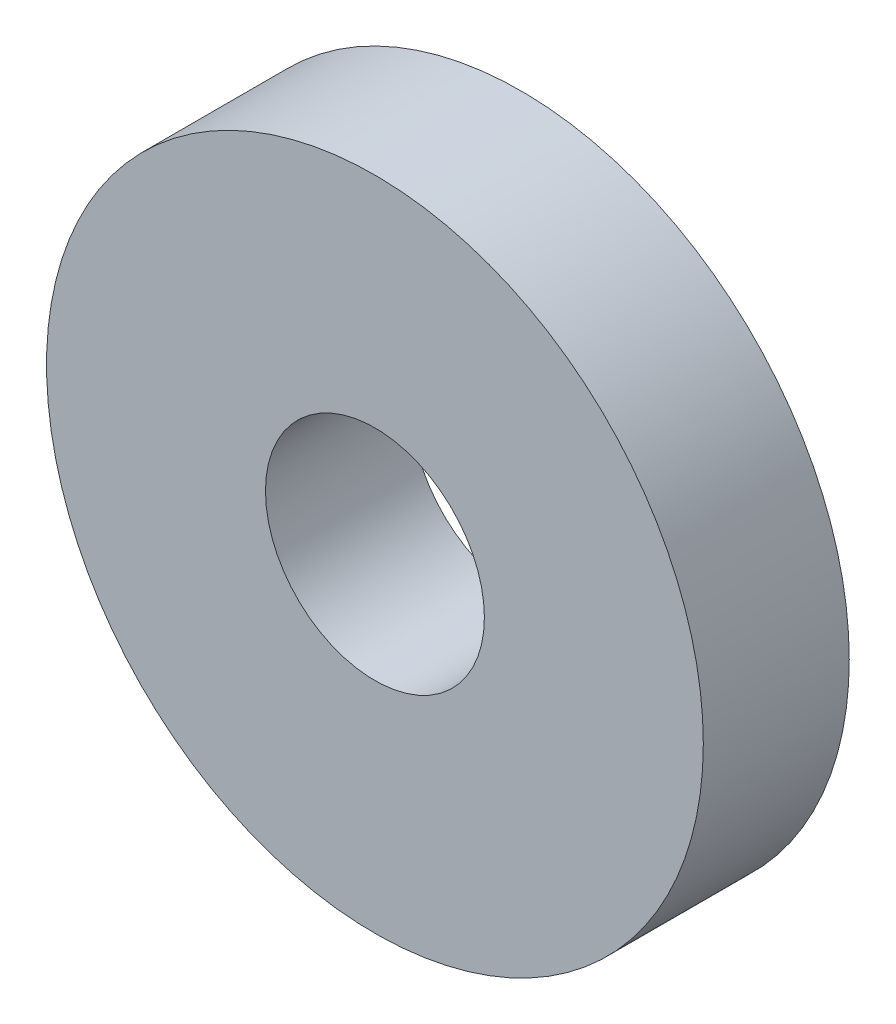
ISO-10303-21;
HEADER;
FILE_DESCRIPTION(('STEP AP214'),'2;1');
FILE_NAME('part.step','',(''),(''),'','','');
FILE_SCHEMA(('AUTOMOTIVE_DESIGN { 1 0 10303 214 1 1 1 1 }'));
ENDSEC;
DATA;
#1=APPLICATION_CONTEXT('core data for automotive mechanical design processes');
#2=APPLICATION_PROTOCOL_DEFINITION('international standard','automotive_design',2000,#1);
#3=PRODUCT_CONTEXT('',#1,'mechanical');
#4=PRODUCT('Part','Part','',(#3));
#5=PRODUCT_RELATED_PRODUCT_CATEGORY('part','',(#4));
#6=PRODUCT_DEFINITION_FORMATION('','',#4);
#7=PRODUCT_DEFINITION_CONTEXT('part definition',#1,'design');
#8=PRODUCT_DEFINITION('design','',#6,#7);
#9=PRODUCT_DEFINITION_SHAPE('','',#8);
#10=(LENGTH_UNIT() NAMED_UNIT(*) SI_UNIT(.MILLI.,.METRE.));
#11=(NAMED_UNIT(*) PLANE_ANGLE_UNIT() SI_UNIT($,.RADIAN.));
#12=(NAMED_UNIT(*) SI_UNIT($,.STERADIAN.) SOLID_ANGLE_UNIT());
#13=UNCERTAINTY_MEASURE_WITH_UNIT(LENGTH_MEASURE(1.E-05),#10,'distance_accuracy_value','');
#14=(GEOMETRIC_REPRESENTATION_CONTEXT(3) GLOBAL_UNCERTAINTY_ASSIGNED_CONTEXT((#13)) GLOBAL_UNIT_ASSIGNED_CONTEXT((#10,
#11,#12)) REPRESENTATION_CONTEXT('',''));
#15=CARTESIAN_POINT('',(0.,0.,0.));
#16=DIRECTION('',(0.,0.,1.));
#17=DIRECTION('',(1.,0.,0.));
#18=AXIS2_PLACEMENT_3D('',#15,#16,#17);
#19=CARTESIAN_POINT('',(0.,0.,2.));
#20=DIRECTION('',(0.,0.,1.));
#21=DIRECTION('',(1.,0.,0.));
#22=AXIS2_PLACEMENT_3D('',#19,#20,#21);
#23=PLANE('',#22);
#24=CARTESIAN_POINT('',(0.,0.,2.));
#25=DIRECTION('',(0.,0.,1.));
#26=DIRECTION('',(1.,0.,0.));
#27=AXIS2_PLACEMENT_3D('',#24,#25,#26);
#28=CIRCLE('',#27,4.5);
#29=CARTESIAN_POINT('',(4.5,0.,2.));
#30=VERTEX_POINT('',#29);
#31=EDGE_CURVE('E10',#30,#30,#28,.T.);
#32=ORIENTED_EDGE('',*,*,#31,.T.);
#33=EDGE_LOOP('',(#32));
#34=FACE_BOUND('',#33,.T.);
#35=CARTESIAN_POINT('',(0.,0.,2.));
#36=DIRECTION('',(0.,0.,1.));
#37=DIRECTION('',(1.,0.,0.));
#38=AXIS2_PLACEMENT_3D('',#35,#36,#37);
#39=CIRCLE('',#38,1.5);
#40=CARTESIAN_POINT('',(1.5,0.,2.));
#41=VERTEX_POINT('',#40);
#42=EDGE_CURVE('E45',#41,#41,#39,.T.);
#43=ORIENTED_EDGE('',*,*,#42,.F.);
#44=EDGE_LOOP('',(#43));
#45=FACE_BOUND('',#44,.T.);
#46=ADVANCED_FACE('F34',(#34,#45),#23,.T.);
#47=CARTESIAN_POINT('',(0.,0.,0.));
#48=DIRECTION('',(0.,0.,1.));
#49=DIRECTION('',(1.,0.,0.));
#50=AXIS2_PLACEMENT_3D('',#47,#48,#49);
#51=PLANE('',#50);
#52=CARTESIAN_POINT('',(0.,0.,0.));
#53=DIRECTION('',(0.,0.,1.));
#54=DIRECTION('',(1.,0.,0.));
#55=AXIS2_PLACEMENT_3D('',#52,#53,#54);
#56=CIRCLE('',#55,4.5);
#57=CARTESIAN_POINT('',(4.5,0.,0.));
#58=VERTEX_POINT('',#57);
#59=EDGE_CURVE('E38',#58,#58,#56,.T.);
#60=ORIENTED_EDGE('',*,*,#59,.F.);
#61=EDGE_LOOP('',(#60));
#62=FACE_BOUND('',#61,.T.);
#63=CARTESIAN_POINT('',(0.,0.,0.));
#64=DIRECTION('',(0.,0.,1.));
#65=DIRECTION('',(1.,0.,0.));
#66=AXIS2_PLACEMENT_3D('',#63,#64,#65);
#67=CIRCLE('',#66,1.5);
#68=CARTESIAN_POINT('',(1.5,0.,0.));
#69=VERTEX_POINT('',#68);
#70=EDGE_CURVE('E47',#69,#69,#67,.T.);
#71=ORIENTED_EDGE('',*,*,#70,.T.);
#72=EDGE_LOOP('',(#71));
#73=FACE_BOUND('',#72,.T.);
#74=ADVANCED_FACE('F57',(#62,#73),#51,.F.);
#75=CARTESIAN_POINT('',(0.,0.,2.));
#76=DIRECTION('',(0.,0.,-1.));
#77=DIRECTION('',(-1.,0.,0.));
#78=AXIS2_PLACEMENT_3D('',#75,#76,#77);
#79=CYLINDRICAL_SURFACE('',#78,4.5);
#80=ORIENTED_EDGE('',*,*,#31,.F.);
#81=EDGE_LOOP('',(#80));
#82=FACE_BOUND('',#81,.T.);
#83=ORIENTED_EDGE('',*,*,#59,.T.);
#84=EDGE_LOOP('',(#83));
#85=FACE_BOUND('',#84,.T.);
#86=ADVANCED_FACE('F36',(#82,#85),#79,.T.);
#87=CARTESIAN_POINT('',(0.,0.,2.));
#88=DIRECTION('',(0.,0.,-1.));
#89=DIRECTION('',(-1.,0.,0.));
#90=AXIS2_PLACEMENT_3D('',#87,#88,#89);
#91=CYLINDRICAL_SURFACE('',#90,1.5);
#92=ORIENTED_EDGE('',*,*,#42,.T.);
#93=EDGE_LOOP('',(#92));
#94=FACE_BOUND('',#93,.T.);
#95=ORIENTED_EDGE('',*,*,#70,.F.);
#96=EDGE_LOOP('',(#95));
#97=FACE_BOUND('',#96,.T.);
#98=ADVANCED_FACE('F53',(#94,#97),#91,.F.);
#99=CLOSED_SHELL('',(#46,#74,#86,#98));
#100=MANIFOLD_SOLID_BREP('B2',#99);
#101=ADVANCED_BREP_SHAPE_REPRESENTATION('',(#18,#100),#14);
#102=SHAPE_DEFINITION_REPRESENTATION(#9,#101);
ENDSEC;
END-ISO-10303-21;
